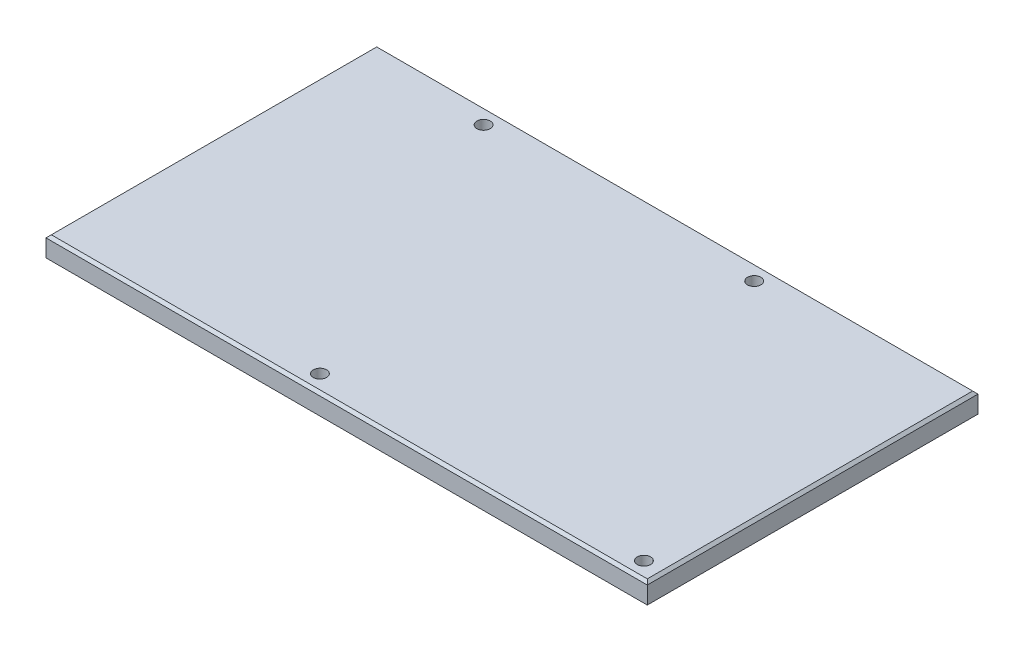
ISO-10303-21;
HEADER;
FILE_DESCRIPTION(('STEP AP214'),'2;1');
FILE_NAME('part.step','',(''),(''),'','','');
FILE_SCHEMA(('AUTOMOTIVE_DESIGN { 1 0 10303 214 1 1 1 1 }'));
ENDSEC;
DATA;
#1=APPLICATION_CONTEXT('core data for automotive mechanical design processes');
#2=APPLICATION_PROTOCOL_DEFINITION('international standard','automotive_design',2000,#1);
#3=PRODUCT_CONTEXT('',#1,'mechanical');
#4=PRODUCT('Part','Part','',(#3));
#5=PRODUCT_RELATED_PRODUCT_CATEGORY('part','',(#4));
#6=PRODUCT_DEFINITION_FORMATION('','',#4);
#7=PRODUCT_DEFINITION_CONTEXT('part definition',#1,'design');
#8=PRODUCT_DEFINITION('design','',#6,#7);
#9=PRODUCT_DEFINITION_SHAPE('','',#8);
#10=(LENGTH_UNIT() NAMED_UNIT(*) SI_UNIT(.MILLI.,.METRE.));
#11=(NAMED_UNIT(*) PLANE_ANGLE_UNIT() SI_UNIT($,.RADIAN.));
#12=(NAMED_UNIT(*) SI_UNIT($,.STERADIAN.) SOLID_ANGLE_UNIT());
#13=UNCERTAINTY_MEASURE_WITH_UNIT(LENGTH_MEASURE(1.E-05),#10,'distance_accuracy_value','');
#14=(GEOMETRIC_REPRESENTATION_CONTEXT(3) GLOBAL_UNCERTAINTY_ASSIGNED_CONTEXT((#13)) GLOBAL_UNIT_ASSIGNED_CONTEXT((#10,
#11,#12)) REPRESENTATION_CONTEXT('',''));
#15=CARTESIAN_POINT('',(0.,0.,0.));
#16=DIRECTION('',(0.,0.,1.));
#17=DIRECTION('',(1.,0.,0.));
#18=AXIS2_PLACEMENT_3D('',#15,#16,#17);
#19=CARTESIAN_POINT('',(-62.8448275862069,6.,-34.9913793103448));
#20=DIRECTION('',(1.,0.,0.));
#21=DIRECTION('',(0.,0.,-1.));
#22=AXIS2_PLACEMENT_3D('',#19,#20,#21);
#23=PLANE('',#22);
#24=DIRECTION('',(0.,-1.,0.));
#25=VECTOR('',#24,1.);
#26=CARTESIAN_POINT('',(-62.8448275862069,6.,64.0086206896552));
#27=LINE('',#26,#25);
#28=CARTESIAN_POINT('',(-62.8448275862069,5.2,64.0086206896552));
#29=VERTEX_POINT('',#28);
#30=CARTESIAN_POINT('',(-62.8448275862069,0.,64.0086206896552));
#31=VERTEX_POINT('',#30);
#32=EDGE_CURVE('E90',#29,#31,#27,.T.);
#33=ORIENTED_EDGE('',*,*,#32,.F.);
#34=DIRECTION('',(0.,0.,-1.));
#35=VECTOR('',#34,1.);
#36=CARTESIAN_POINT('',(-62.8448275862069,5.2,-34.9913793103448));
#37=LINE('',#36,#35);
#38=CARTESIAN_POINT('',(-62.8448275862069,5.2,-34.9913793103448));
#39=VERTEX_POINT('',#38);
#40=EDGE_CURVE('E135',#29,#39,#37,.T.);
#41=ORIENTED_EDGE('',*,*,#40,.T.);
#42=DIRECTION('',(0.,-1.,0.));
#43=VECTOR('',#42,1.);
#44=CARTESIAN_POINT('',(-62.8448275862069,6.,-34.9913793103448));
#45=LINE('',#44,#43);
#46=CARTESIAN_POINT('',(-62.8448275862069,0.,-34.9913793103448));
#47=VERTEX_POINT('',#46);
#48=EDGE_CURVE('E111',#39,#47,#45,.T.);
#49=ORIENTED_EDGE('',*,*,#48,.T.);
#50=DIRECTION('',(0.,0.,1.));
#51=VECTOR('',#50,1.);
#52=CARTESIAN_POINT('',(-62.8448275862069,0.,-34.9913793103448));
#53=LINE('',#52,#51);
#54=EDGE_CURVE('E107',#47,#31,#53,.T.);
#55=ORIENTED_EDGE('',*,*,#54,.T.);
#56=EDGE_LOOP('',(#33,#41,#49,#55));
#57=FACE_BOUND('',#56,.T.);
#58=ADVANCED_FACE('F35',(#57),#23,.F.);
#59=CARTESIAN_POINT('',(-62.8448275862069,6.,64.0086206896552));
#60=DIRECTION('',(0.,0.,-1.));
#61=DIRECTION('',(-1.,0.,0.));
#62=AXIS2_PLACEMENT_3D('',#59,#60,#61);
#63=PLANE('',#62);
#64=DIRECTION('',(0.,-1.,0.));
#65=VECTOR('',#64,1.);
#66=CARTESIAN_POINT('',(117.155172413793,6.,64.0086206896552));
#67=LINE('',#66,#65);
#68=CARTESIAN_POINT('',(117.155172413793,5.2,64.0086206896552));
#69=VERTEX_POINT('',#68);
#70=CARTESIAN_POINT('',(117.155172413793,0.,64.0086206896552));
#71=VERTEX_POINT('',#70);
#72=EDGE_CURVE('E101',#69,#71,#67,.T.);
#73=ORIENTED_EDGE('',*,*,#72,.F.);
#74=DIRECTION('',(-1.,0.,0.));
#75=VECTOR('',#74,1.);
#76=CARTESIAN_POINT('',(-62.8448275862069,5.2,64.0086206896552));
#77=LINE('',#76,#75);
#78=EDGE_CURVE('E11',#69,#29,#77,.T.);
#79=ORIENTED_EDGE('',*,*,#78,.T.);
#80=ORIENTED_EDGE('',*,*,#32,.T.);
#81=DIRECTION('',(1.,0.,0.));
#82=VECTOR('',#81,1.);
#83=CARTESIAN_POINT('',(-62.8448275862069,0.,64.0086206896552));
#84=LINE('',#83,#82);
#85=EDGE_CURVE('E93',#31,#71,#84,.T.);
#86=ORIENTED_EDGE('',*,*,#85,.T.);
#87=EDGE_LOOP('',(#73,#79,#80,#86));
#88=FACE_BOUND('',#87,.T.);
#89=ADVANCED_FACE('F92',(#88),#63,.F.);
#90=CARTESIAN_POINT('',(117.155172413793,6.,-34.9913793103448));
#91=DIRECTION('',(-1.,0.,0.));
#92=DIRECTION('',(0.,0.,1.));
#93=AXIS2_PLACEMENT_3D('',#90,#91,#92);
#94=PLANE('',#93);
#95=DIRECTION('',(0.,-1.,0.));
#96=VECTOR('',#95,1.);
#97=CARTESIAN_POINT('',(117.155172413793,6.,-34.9913793103448));
#98=LINE('',#97,#96);
#99=CARTESIAN_POINT('',(117.155172413793,5.2,-34.9913793103448));
#100=VERTEX_POINT('',#99);
#101=CARTESIAN_POINT('',(117.155172413793,0.,-34.9913793103448));
#102=VERTEX_POINT('',#101);
#103=EDGE_CURVE('E124',#100,#102,#98,.T.);
#104=ORIENTED_EDGE('',*,*,#103,.F.);
#105=DIRECTION('',(0.,0.,1.));
#106=VECTOR('',#105,1.);
#107=CARTESIAN_POINT('',(117.155172413793,5.2,64.0086206896552));
#108=LINE('',#107,#106);
#109=EDGE_CURVE('E45',#100,#69,#108,.T.);
#110=ORIENTED_EDGE('',*,*,#109,.T.);
#111=ORIENTED_EDGE('',*,*,#72,.T.);
#112=DIRECTION('',(0.,0.,-1.));
#113=VECTOR('',#112,1.);
#114=CARTESIAN_POINT('',(117.155172413793,0.,-34.9913793103448));
#115=LINE('',#114,#113);
#116=EDGE_CURVE('E109',#71,#102,#115,.T.);
#117=ORIENTED_EDGE('',*,*,#116,.T.);
#118=EDGE_LOOP('',(#104,#110,#111,#117));
#119=FACE_BOUND('',#118,.T.);
#120=ADVANCED_FACE('F186',(#119),#94,.F.);
#121=CARTESIAN_POINT('',(-62.8448275862069,6.,-34.9913793103448));
#122=DIRECTION('',(0.,0.,1.));
#123=DIRECTION('',(1.,0.,0.));
#124=AXIS2_PLACEMENT_3D('',#121,#122,#123);
#125=PLANE('',#124);
#126=ORIENTED_EDGE('',*,*,#48,.F.);
#127=DIRECTION('',(1.,0.,0.));
#128=VECTOR('',#127,1.);
#129=CARTESIAN_POINT('',(117.155172413793,5.2,-34.9913793103448));
#130=LINE('',#129,#128);
#131=EDGE_CURVE('E60',#39,#100,#130,.T.);
#132=ORIENTED_EDGE('',*,*,#131,.T.);
#133=ORIENTED_EDGE('',*,*,#103,.T.);
#134=DIRECTION('',(-1.,0.,0.));
#135=VECTOR('',#134,1.);
#136=CARTESIAN_POINT('',(-62.8448275862069,0.,-34.9913793103448));
#137=LINE('',#136,#135);
#138=EDGE_CURVE('E121',#102,#47,#137,.T.);
#139=ORIENTED_EDGE('',*,*,#138,.T.);
#140=EDGE_LOOP('',(#126,#132,#133,#139));
#141=FACE_BOUND('',#140,.T.);
#142=ADVANCED_FACE('F178',(#141),#125,.F.);
#143=CARTESIAN_POINT('',(0.,6.,0.));
#144=DIRECTION('',(0.,1.,0.));
#145=DIRECTION('',(0.,0.,1.));
#146=AXIS2_PLACEMENT_3D('',#143,#144,#145);
#147=PLANE('',#146);
#148=DIRECTION('',(-1.,0.,0.));
#149=VECTOR('',#148,1.);
#150=CARTESIAN_POINT('',(-62.8448275862069,6.,-34.1913793103448));
#151=LINE('',#150,#149);
#152=CARTESIAN_POINT('',(116.355172413793,6.,-34.1913793103448));
#153=VERTEX_POINT('',#152);
#154=CARTESIAN_POINT('',(-62.0448275862069,6.,-34.1913793103448));
#155=VERTEX_POINT('',#154);
#156=EDGE_CURVE('E130',#153,#155,#151,.T.);
#157=ORIENTED_EDGE('',*,*,#156,.T.);
#158=DIRECTION('',(0.,0.,1.));
#159=VECTOR('',#158,1.);
#160=CARTESIAN_POINT('',(-62.0448275862069,6.,64.0086206896552));
#161=LINE('',#160,#159);
#162=CARTESIAN_POINT('',(-62.0448275862069,6.,63.2086206896552));
#163=VERTEX_POINT('',#162);
#164=EDGE_CURVE('E132',#155,#163,#161,.T.);
#165=ORIENTED_EDGE('',*,*,#164,.T.);
#166=DIRECTION('',(1.,0.,0.));
#167=VECTOR('',#166,1.);
#168=CARTESIAN_POINT('',(117.155172413793,6.,63.2086206896552));
#169=LINE('',#168,#167);
#170=CARTESIAN_POINT('',(116.355172413793,6.,63.2086206896552));
#171=VERTEX_POINT('',#170);
#172=EDGE_CURVE('E100',#163,#171,#169,.T.);
#173=ORIENTED_EDGE('',*,*,#172,.T.);
#174=DIRECTION('',(0.,0.,-1.));
#175=VECTOR('',#174,1.);
#176=CARTESIAN_POINT('',(116.355172413793,6.,-34.9913793103448));
#177=LINE('',#176,#175);
#178=EDGE_CURVE('E128',#171,#153,#177,.T.);
#179=ORIENTED_EDGE('',*,*,#178,.T.);
#180=EDGE_LOOP('',(#157,#165,#173,#179));
#181=FACE_BOUND('',#180,.T.);
#182=CARTESIAN_POINT('',(-25.8448275862069,6.,-29.9913793103448));
#183=DIRECTION('',(0.,1.,0.));
#184=DIRECTION('',(0.,0.,1.));
#185=AXIS2_PLACEMENT_3D('',#182,#183,#184);
#186=CIRCLE('',#185,1.99999999999999);
#187=CARTESIAN_POINT('',(-25.8448275862069,6.,-27.9913793103448));
#188=VERTEX_POINT('',#187);
#189=EDGE_CURVE('E153',#188,#188,#186,.T.);
#190=ORIENTED_EDGE('',*,*,#189,.F.);
#191=EDGE_LOOP('',(#190));
#192=FACE_BOUND('',#191,.T.);
#193=CARTESIAN_POINT('',(14.1551724137931,6.,59.0086206896552));
#194=DIRECTION('',(0.,1.,0.));
#195=DIRECTION('',(0.,0.,1.));
#196=AXIS2_PLACEMENT_3D('',#193,#194,#195);
#197=CIRCLE('',#196,1.99999999999999);
#198=CARTESIAN_POINT('',(14.1551724137931,6.,61.0086206896552));
#199=VERTEX_POINT('',#198);
#200=EDGE_CURVE('E163',#199,#199,#197,.T.);
#201=ORIENTED_EDGE('',*,*,#200,.F.);
#202=EDGE_LOOP('',(#201));
#203=FACE_BOUND('',#202,.T.);
#204=CARTESIAN_POINT('',(55.1551724137931,6.,-29.9913793103448));
#205=DIRECTION('',(0.,1.,0.));
#206=DIRECTION('',(0.,0.,1.));
#207=AXIS2_PLACEMENT_3D('',#204,#205,#206);
#208=CIRCLE('',#207,1.99999999999999);
#209=CARTESIAN_POINT('',(55.1551724137931,6.,-27.9913793103448));
#210=VERTEX_POINT('',#209);
#211=EDGE_CURVE('E166',#210,#210,#208,.T.);
#212=ORIENTED_EDGE('',*,*,#211,.F.);
#213=EDGE_LOOP('',(#212));
#214=FACE_BOUND('',#213,.T.);
#215=CARTESIAN_POINT('',(111.155172413793,6.,59.0086206896552));
#216=DIRECTION('',(0.,1.,0.));
#217=DIRECTION('',(0.,0.,1.));
#218=AXIS2_PLACEMENT_3D('',#215,#216,#217);
#219=CIRCLE('',#218,1.99999999999999);
#220=CARTESIAN_POINT('',(111.155172413793,6.,61.0086206896552));
#221=VERTEX_POINT('',#220);
#222=EDGE_CURVE('E116',#221,#221,#219,.T.);
#223=ORIENTED_EDGE('',*,*,#222,.F.);
#224=EDGE_LOOP('',(#223));
#225=FACE_BOUND('',#224,.T.);
#226=ADVANCED_FACE('F176',(#181,#192,#203,#214,#225),#147,.T.);
#227=CARTESIAN_POINT('',(0.,0.,0.));
#228=DIRECTION('',(0.,1.,0.));
#229=DIRECTION('',(0.,0.,1.));
#230=AXIS2_PLACEMENT_3D('',#227,#228,#229);
#231=PLANE('',#230);
#232=CARTESIAN_POINT('',(-25.8448275862069,0.,-29.9913793103448));
#233=DIRECTION('',(0.,1.,0.));
#234=DIRECTION('',(0.,0.,1.));
#235=AXIS2_PLACEMENT_3D('',#232,#233,#234);
#236=CIRCLE('',#235,1.99999999999999);
#237=CARTESIAN_POINT('',(-25.8448275862069,0.,-27.9913793103448));
#238=VERTEX_POINT('',#237);
#239=EDGE_CURVE('E148',#238,#238,#236,.T.);
#240=ORIENTED_EDGE('',*,*,#239,.T.);
#241=EDGE_LOOP('',(#240));
#242=FACE_BOUND('',#241,.T.);
#243=CARTESIAN_POINT('',(14.1551724137931,0.,59.0086206896552));
#244=DIRECTION('',(0.,1.,0.));
#245=DIRECTION('',(0.,0.,1.));
#246=AXIS2_PLACEMENT_3D('',#243,#244,#245);
#247=CIRCLE('',#246,2.);
#248=CARTESIAN_POINT('',(14.1551724137931,0.,61.0086206896552));
#249=VERTEX_POINT('',#248);
#250=EDGE_CURVE('E158',#249,#249,#247,.T.);
#251=ORIENTED_EDGE('',*,*,#250,.T.);
#252=EDGE_LOOP('',(#251));
#253=FACE_BOUND('',#252,.T.);
#254=CARTESIAN_POINT('',(55.1551724137931,0.,-29.9913793103448));
#255=DIRECTION('',(0.,1.,0.));
#256=DIRECTION('',(0.,0.,1.));
#257=AXIS2_PLACEMENT_3D('',#254,#255,#256);
#258=CIRCLE('',#257,1.99999999999999);
#259=CARTESIAN_POINT('',(55.1551724137931,0.,-27.9913793103448));
#260=VERTEX_POINT('',#259);
#261=EDGE_CURVE('E169',#260,#260,#258,.T.);
#262=ORIENTED_EDGE('',*,*,#261,.T.);
#263=EDGE_LOOP('',(#262));
#264=FACE_BOUND('',#263,.T.);
#265=CARTESIAN_POINT('',(111.155172413793,0.,59.0086206896552));
#266=DIRECTION('',(0.,1.,0.));
#267=DIRECTION('',(0.,0.,1.));
#268=AXIS2_PLACEMENT_3D('',#265,#266,#267);
#269=CIRCLE('',#268,2.);
#270=CARTESIAN_POINT('',(111.155172413793,0.,61.0086206896552));
#271=VERTEX_POINT('',#270);
#272=EDGE_CURVE('E113',#271,#271,#269,.T.);
#273=ORIENTED_EDGE('',*,*,#272,.T.);
#274=EDGE_LOOP('',(#273));
#275=FACE_BOUND('',#274,.T.);
#276=ORIENTED_EDGE('',*,*,#54,.F.);
#277=ORIENTED_EDGE('',*,*,#138,.F.);
#278=ORIENTED_EDGE('',*,*,#116,.F.);
#279=ORIENTED_EDGE('',*,*,#85,.F.);
#280=EDGE_LOOP('',(#276,#277,#278,#279));
#281=FACE_BOUND('',#280,.T.);
#282=ADVANCED_FACE('F105',(#242,#253,#264,#275,#281),#231,.F.);
#283=CARTESIAN_POINT('',(111.155172413793,6.,59.0086206896552));
#284=DIRECTION('',(0.,1.,0.));
#285=DIRECTION('',(0.,0.,1.));
#286=AXIS2_PLACEMENT_3D('',#283,#284,#285);
#287=CYLINDRICAL_SURFACE('',#286,1.99999999999999);
#288=ORIENTED_EDGE('',*,*,#272,.F.);
#289=EDGE_LOOP('',(#288));
#290=FACE_BOUND('',#289,.T.);
#291=ORIENTED_EDGE('',*,*,#222,.T.);
#292=EDGE_LOOP('',(#291));
#293=FACE_BOUND('',#292,.T.);
#294=ADVANCED_FACE('F174',(#290,#293),#287,.F.);
#295=CARTESIAN_POINT('',(55.1551724137931,6.,-29.9913793103448));
#296=DIRECTION('',(0.,1.,0.));
#297=DIRECTION('',(0.,0.,1.));
#298=AXIS2_PLACEMENT_3D('',#295,#296,#297);
#299=CYLINDRICAL_SURFACE('',#298,1.99999999999999);
#300=ORIENTED_EDGE('',*,*,#261,.F.);
#301=EDGE_LOOP('',(#300));
#302=FACE_BOUND('',#301,.T.);
#303=ORIENTED_EDGE('',*,*,#211,.T.);
#304=EDGE_LOOP('',(#303));
#305=FACE_BOUND('',#304,.T.);
#306=ADVANCED_FACE('F280',(#302,#305),#299,.F.);
#307=CARTESIAN_POINT('',(14.1551724137931,6.,59.0086206896552));
#308=DIRECTION('',(0.,1.,0.));
#309=DIRECTION('',(0.,0.,1.));
#310=AXIS2_PLACEMENT_3D('',#307,#308,#309);
#311=CYLINDRICAL_SURFACE('',#310,1.99999999999999);
#312=ORIENTED_EDGE('',*,*,#250,.F.);
#313=EDGE_LOOP('',(#312));
#314=FACE_BOUND('',#313,.T.);
#315=ORIENTED_EDGE('',*,*,#200,.T.);
#316=EDGE_LOOP('',(#315));
#317=FACE_BOUND('',#316,.T.);
#318=ADVANCED_FACE('F223',(#314,#317),#311,.F.);
#319=CARTESIAN_POINT('',(-25.8448275862069,6.,-29.9913793103448));
#320=DIRECTION('',(0.,1.,0.));
#321=DIRECTION('',(0.,0.,1.));
#322=AXIS2_PLACEMENT_3D('',#319,#320,#321);
#323=CYLINDRICAL_SURFACE('',#322,1.99999999999999);
#324=ORIENTED_EDGE('',*,*,#239,.F.);
#325=EDGE_LOOP('',(#324));
#326=FACE_BOUND('',#325,.T.);
#327=ORIENTED_EDGE('',*,*,#189,.T.);
#328=EDGE_LOOP('',(#327));
#329=FACE_BOUND('',#328,.T.);
#330=ADVANCED_FACE('F218',(#326,#329),#323,.F.);
#331=CARTESIAN_POINT('',(116.355172413793,6.,0.));
#332=DIRECTION('',(0.707106781186548,0.707106781186548,0.));
#333=DIRECTION('',(0.,0.,1.));
#334=AXIS2_PLACEMENT_3D('',#331,#332,#333);
#335=PLANE('',#334);
#336=DIRECTION('',(-0.577350269189626,0.577350269189626,-0.577350269189626));
#337=VECTOR('',#336,1.);
#338=CARTESIAN_POINT('',(77.5701149425287,44.7850574712644,24.4235632183908));
#339=LINE('',#338,#337);
#340=EDGE_CURVE('E142',#69,#171,#339,.T.);
#341=ORIENTED_EDGE('',*,*,#340,.F.);
#342=ORIENTED_EDGE('',*,*,#109,.F.);
#343=DIRECTION('',(-0.577350269189626,0.577350269189626,0.577350269189626));
#344=VECTOR('',#343,1.);
#345=CARTESIAN_POINT('',(104.958045977012,17.3971264367816,-22.7942528735632));
#346=LINE('',#345,#344);
#347=EDGE_CURVE('E40',#153,#100,#346,.F.);
#348=ORIENTED_EDGE('',*,*,#347,.F.);
#349=ORIENTED_EDGE('',*,*,#178,.F.);
#350=EDGE_LOOP('',(#341,#342,#348,#349));
#351=FACE_BOUND('',#350,.T.);
#352=ADVANCED_FACE('F38',(#351),#335,.T.);
#353=CARTESIAN_POINT('',(0.,6.,-34.1913793103448));
#354=DIRECTION('',(0.,0.707106781186548,-0.707106781186548));
#355=DIRECTION('',(1.,0.,0.));
#356=AXIS2_PLACEMENT_3D('',#353,#354,#355);
#357=PLANE('',#356);
#358=ORIENTED_EDGE('',*,*,#347,.T.);
#359=ORIENTED_EDGE('',*,*,#131,.F.);
#360=DIRECTION('',(0.577350269189627,0.577350269189625,0.577350269189625));
#361=VECTOR('',#360,1.);
#362=CARTESIAN_POINT('',(-41.3632183908045,26.6816091954023,-13.5097701149425));
#363=LINE('',#362,#361);
#364=EDGE_CURVE('E141',#155,#39,#363,.F.);
#365=ORIENTED_EDGE('',*,*,#364,.F.);
#366=ORIENTED_EDGE('',*,*,#156,.F.);
#367=EDGE_LOOP('',(#358,#359,#365,#366));
#368=FACE_BOUND('',#367,.T.);
#369=ADVANCED_FACE('F211',(#368),#357,.T.);
#370=CARTESIAN_POINT('',(0.,6.,63.2086206896552));
#371=DIRECTION('',(0.,0.707106781186548,0.707106781186548));
#372=DIRECTION('',(-1.,0.,0.));
#373=AXIS2_PLACEMENT_3D('',#370,#371,#372);
#374=PLANE('',#373);
#375=ORIENTED_EDGE('',*,*,#340,.T.);
#376=ORIENTED_EDGE('',*,*,#172,.F.);
#377=DIRECTION('',(-0.577350269189627,-0.577350269189625,0.577350269189625));
#378=VECTOR('',#377,1.);
#379=CARTESIAN_POINT('',(-41.3632183908045,26.6816091954023,42.5270114942529));
#380=LINE('',#379,#378);
#381=EDGE_CURVE('E139',#29,#163,#380,.F.);
#382=ORIENTED_EDGE('',*,*,#381,.F.);
#383=ORIENTED_EDGE('',*,*,#78,.F.);
#384=EDGE_LOOP('',(#375,#376,#382,#383));
#385=FACE_BOUND('',#384,.T.);
#386=ADVANCED_FACE('F205',(#385),#374,.T.);
#387=CARTESIAN_POINT('',(-62.0448275862069,6.,0.));
#388=DIRECTION('',(-0.707106781186547,0.707106781186548,0.));
#389=DIRECTION('',(0.,0.,-1.));
#390=AXIS2_PLACEMENT_3D('',#387,#388,#389);
#391=PLANE('',#390);
#392=ORIENTED_EDGE('',*,*,#364,.T.);
#393=ORIENTED_EDGE('',*,*,#40,.F.);
#394=ORIENTED_EDGE('',*,*,#381,.T.);
#395=ORIENTED_EDGE('',*,*,#164,.F.);
#396=EDGE_LOOP('',(#392,#393,#394,#395));
#397=FACE_BOUND('',#396,.T.);
#398=ADVANCED_FACE('F199',(#397),#391,.T.);
#399=CLOSED_SHELL('',(#58,#89,#120,#142,#226,#282,#294,#306,#318,#330,#352,#369,#386,#398));
#400=MANIFOLD_SOLID_BREP('B2',#399);
#401=ADVANCED_BREP_SHAPE_REPRESENTATION('',(#18,#400),#14);
#402=SHAPE_DEFINITION_REPRESENTATION(#9,#401);
ENDSEC;
END-ISO-10303-21;
